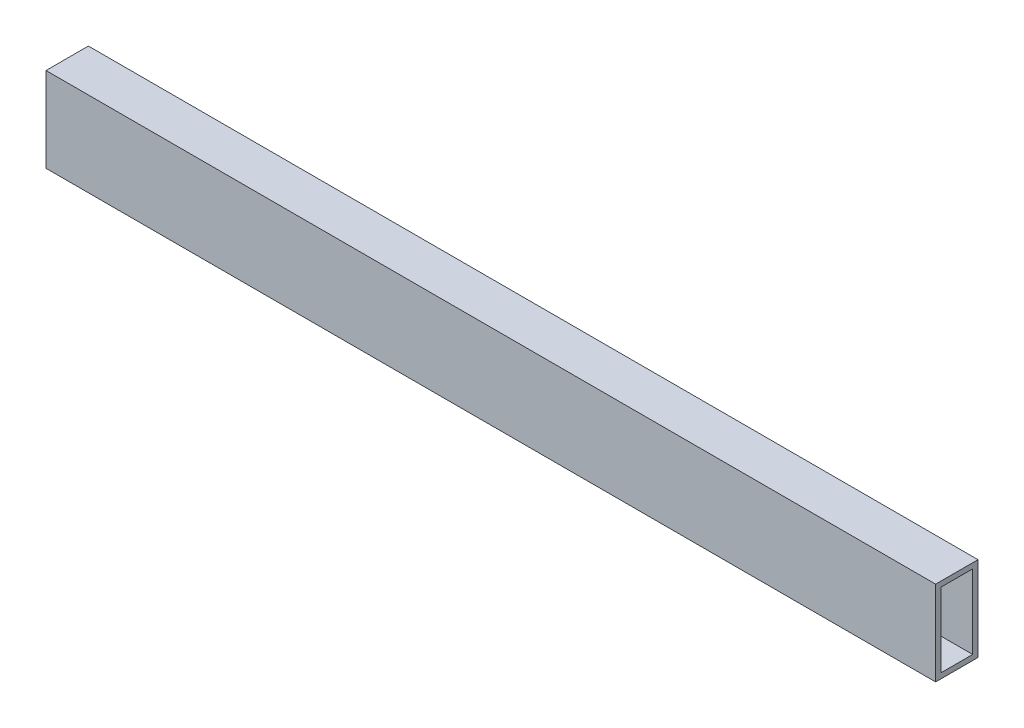
ISO-10303-21;
HEADER;
FILE_DESCRIPTION(('STEP AP214'),'2;1');
FILE_NAME('part.step','',(''),(''),'','','');
FILE_SCHEMA(('AUTOMOTIVE_DESIGN { 1 0 10303 214 1 1 1 1 }'));
ENDSEC;
DATA;
#1=APPLICATION_CONTEXT('core data for automotive mechanical design processes');
#2=APPLICATION_PROTOCOL_DEFINITION('international standard','automotive_design',2000,#1);
#3=PRODUCT_CONTEXT('',#1,'mechanical');
#4=PRODUCT('Part','Part','',(#3));
#5=PRODUCT_RELATED_PRODUCT_CATEGORY('part','',(#4));
#6=PRODUCT_DEFINITION_FORMATION('','',#4);
#7=PRODUCT_DEFINITION_CONTEXT('part definition',#1,'design');
#8=PRODUCT_DEFINITION('design','',#6,#7);
#9=PRODUCT_DEFINITION_SHAPE('','',#8);
#10=(LENGTH_UNIT() NAMED_UNIT(*) SI_UNIT(.MILLI.,.METRE.));
#11=(NAMED_UNIT(*) PLANE_ANGLE_UNIT() SI_UNIT($,.RADIAN.));
#12=(NAMED_UNIT(*) SI_UNIT($,.STERADIAN.) SOLID_ANGLE_UNIT());
#13=UNCERTAINTY_MEASURE_WITH_UNIT(LENGTH_MEASURE(1.E-05),#10,'distance_accuracy_value','');
#14=(GEOMETRIC_REPRESENTATION_CONTEXT(3) GLOBAL_UNCERTAINTY_ASSIGNED_CONTEXT((#13)) GLOBAL_UNIT_ASSIGNED_CONTEXT((#10,
#11,#12)) REPRESENTATION_CONTEXT('',''));
#15=CARTESIAN_POINT('',(0.,0.,0.));
#16=DIRECTION('',(0.,0.,1.));
#17=DIRECTION('',(1.,0.,0.));
#18=AXIS2_PLACEMENT_3D('',#15,#16,#17);
#19=CARTESIAN_POINT('',(533.4,0.,0.));
#20=DIRECTION('',(-1.,0.,0.));
#21=DIRECTION('',(0.,0.,1.));
#22=AXIS2_PLACEMENT_3D('',#19,#20,#21);
#23=PLANE('',#22);
#24=DIRECTION('',(0.,-1.,0.));
#25=VECTOR('',#24,1.);
#26=CARTESIAN_POINT('',(533.4,0.,0.));
#27=LINE('',#26,#25);
#28=CARTESIAN_POINT('',(533.4,50.8,0.));
#29=VERTEX_POINT('',#28);
#30=CARTESIAN_POINT('',(533.4,0.,0.));
#31=VERTEX_POINT('',#30);
#32=EDGE_CURVE('E134',#29,#31,#27,.T.);
#33=ORIENTED_EDGE('',*,*,#32,.T.);
#34=DIRECTION('',(0.,0.,-1.));
#35=VECTOR('',#34,1.);
#36=CARTESIAN_POINT('',(533.4,0.,0.));
#37=LINE('',#36,#35);
#38=CARTESIAN_POINT('',(533.4,0.,-25.4));
#39=VERTEX_POINT('',#38);
#40=EDGE_CURVE('E137',#31,#39,#37,.T.);
#41=ORIENTED_EDGE('',*,*,#40,.T.);
#42=DIRECTION('',(0.,1.,0.));
#43=VECTOR('',#42,1.);
#44=CARTESIAN_POINT('',(533.4,0.,-25.4));
#45=LINE('',#44,#43);
#46=CARTESIAN_POINT('',(533.4,50.8,-25.4));
#47=VERTEX_POINT('',#46);
#48=EDGE_CURVE('E140',#39,#47,#45,.T.);
#49=ORIENTED_EDGE('',*,*,#48,.T.);
#50=DIRECTION('',(0.,0.,1.));
#51=VECTOR('',#50,1.);
#52=CARTESIAN_POINT('',(533.4,50.8,0.));
#53=LINE('',#52,#51);
#54=EDGE_CURVE('E142',#47,#29,#53,.T.);
#55=ORIENTED_EDGE('',*,*,#54,.T.);
#56=EDGE_LOOP('',(#33,#41,#49,#55));
#57=FACE_BOUND('',#56,.T.);
#58=DIRECTION('',(0.,-1.,0.));
#59=VECTOR('',#58,1.);
#60=CARTESIAN_POINT('',(533.4,47.625,-3.175));
#61=LINE('',#60,#59);
#62=CARTESIAN_POINT('',(533.4,47.625,-3.175));
#63=VERTEX_POINT('',#62);
#64=CARTESIAN_POINT('',(533.4,3.175,-3.175));
#65=VERTEX_POINT('',#64);
#66=EDGE_CURVE('E98',#63,#65,#61,.T.);
#67=ORIENTED_EDGE('',*,*,#66,.F.);
#68=DIRECTION('',(0.,0.,1.));
#69=VECTOR('',#68,1.);
#70=CARTESIAN_POINT('',(533.4,47.625,-3.175));
#71=LINE('',#70,#69);
#72=CARTESIAN_POINT('',(533.4,47.625,-22.225));
#73=VERTEX_POINT('',#72);
#74=EDGE_CURVE('E120',#73,#63,#71,.T.);
#75=ORIENTED_EDGE('',*,*,#74,.F.);
#76=DIRECTION('',(0.,1.,0.));
#77=VECTOR('',#76,1.);
#78=CARTESIAN_POINT('',(533.4,47.625,-22.225));
#79=LINE('',#78,#77);
#80=CARTESIAN_POINT('',(533.4,3.175,-22.225));
#81=VERTEX_POINT('',#80);
#82=EDGE_CURVE('E118',#81,#73,#79,.T.);
#83=ORIENTED_EDGE('',*,*,#82,.F.);
#84=DIRECTION('',(0.,0.,-1.));
#85=VECTOR('',#84,1.);
#86=CARTESIAN_POINT('',(533.4,3.175,-3.175));
#87=LINE('',#86,#85);
#88=EDGE_CURVE('E106',#65,#81,#87,.T.);
#89=ORIENTED_EDGE('',*,*,#88,.F.);
#90=EDGE_LOOP('',(#67,#75,#83,#89));
#91=FACE_BOUND('',#90,.T.);
#92=ADVANCED_FACE('F33',(#57,#91),#23,.F.);
#93=CARTESIAN_POINT('',(0.,0.,0.));
#94=DIRECTION('',(-1.,0.,0.));
#95=DIRECTION('',(0.,0.,1.));
#96=AXIS2_PLACEMENT_3D('',#93,#94,#95);
#97=PLANE('',#96);
#98=DIRECTION('',(0.,-1.,0.));
#99=VECTOR('',#98,1.);
#100=CARTESIAN_POINT('',(0.,0.,0.));
#101=LINE('',#100,#99);
#102=CARTESIAN_POINT('',(0.,50.8,0.));
#103=VERTEX_POINT('',#102);
#104=CARTESIAN_POINT('',(0.,0.,0.));
#105=VERTEX_POINT('',#104);
#106=EDGE_CURVE('E114',#103,#105,#101,.T.);
#107=ORIENTED_EDGE('',*,*,#106,.F.);
#108=DIRECTION('',(0.,0.,1.));
#109=VECTOR('',#108,1.);
#110=CARTESIAN_POINT('',(0.,50.8,0.));
#111=LINE('',#110,#109);
#112=CARTESIAN_POINT('',(0.,50.8,-25.4));
#113=VERTEX_POINT('',#112);
#114=EDGE_CURVE('E138',#113,#103,#111,.T.);
#115=ORIENTED_EDGE('',*,*,#114,.F.);
#116=DIRECTION('',(0.,1.,0.));
#117=VECTOR('',#116,1.);
#118=CARTESIAN_POINT('',(0.,0.,-25.4));
#119=LINE('',#118,#117);
#120=CARTESIAN_POINT('',(0.,0.,-25.4));
#121=VERTEX_POINT('',#120);
#122=EDGE_CURVE('E149',#121,#113,#119,.T.);
#123=ORIENTED_EDGE('',*,*,#122,.F.);
#124=DIRECTION('',(0.,0.,-1.));
#125=VECTOR('',#124,1.);
#126=CARTESIAN_POINT('',(0.,0.,0.));
#127=LINE('',#126,#125);
#128=EDGE_CURVE('E147',#105,#121,#127,.T.);
#129=ORIENTED_EDGE('',*,*,#128,.F.);
#130=EDGE_LOOP('',(#107,#115,#123,#129));
#131=FACE_BOUND('',#130,.T.);
#132=DIRECTION('',(0.,0.,1.));
#133=VECTOR('',#132,1.);
#134=CARTESIAN_POINT('',(0.,47.625,-3.175));
#135=LINE('',#134,#133);
#136=CARTESIAN_POINT('',(0.,47.625,-22.225));
#137=VERTEX_POINT('',#136);
#138=CARTESIAN_POINT('',(0.,47.625,-3.175));
#139=VERTEX_POINT('',#138);
#140=EDGE_CURVE('E107',#137,#139,#135,.T.);
#141=ORIENTED_EDGE('',*,*,#140,.T.);
#142=DIRECTION('',(0.,-1.,0.));
#143=VECTOR('',#142,1.);
#144=CARTESIAN_POINT('',(0.,47.625,-3.175));
#145=LINE('',#144,#143);
#146=CARTESIAN_POINT('',(0.,3.175,-3.175));
#147=VERTEX_POINT('',#146);
#148=EDGE_CURVE('E56',#139,#147,#145,.T.);
#149=ORIENTED_EDGE('',*,*,#148,.T.);
#150=DIRECTION('',(0.,0.,-1.));
#151=VECTOR('',#150,1.);
#152=CARTESIAN_POINT('',(0.,3.175,-3.175));
#153=LINE('',#152,#151);
#154=CARTESIAN_POINT('',(0.,3.175,-22.225));
#155=VERTEX_POINT('',#154);
#156=EDGE_CURVE('E113',#147,#155,#153,.T.);
#157=ORIENTED_EDGE('',*,*,#156,.T.);
#158=DIRECTION('',(0.,1.,0.));
#159=VECTOR('',#158,1.);
#160=CARTESIAN_POINT('',(0.,47.625,-22.225));
#161=LINE('',#160,#159);
#162=EDGE_CURVE('E126',#155,#137,#161,.T.);
#163=ORIENTED_EDGE('',*,*,#162,.T.);
#164=EDGE_LOOP('',(#141,#149,#157,#163));
#165=FACE_BOUND('',#164,.T.);
#166=ADVANCED_FACE('F167',(#131,#165),#97,.T.);
#167=CARTESIAN_POINT('',(533.4,0.,0.));
#168=DIRECTION('',(0.,0.,-1.));
#169=DIRECTION('',(-1.,0.,0.));
#170=AXIS2_PLACEMENT_3D('',#167,#168,#169);
#171=PLANE('',#170);
#172=ORIENTED_EDGE('',*,*,#106,.T.);
#173=DIRECTION('',(-1.,0.,0.));
#174=VECTOR('',#173,1.);
#175=CARTESIAN_POINT('',(533.4,0.,0.));
#176=LINE('',#175,#174);
#177=EDGE_CURVE('E11',#31,#105,#176,.T.);
#178=ORIENTED_EDGE('',*,*,#177,.F.);
#179=ORIENTED_EDGE('',*,*,#32,.F.);
#180=DIRECTION('',(-1.,0.,0.));
#181=VECTOR('',#180,1.);
#182=CARTESIAN_POINT('',(533.4,50.8,0.));
#183=LINE('',#182,#181);
#184=EDGE_CURVE('E144',#29,#103,#183,.T.);
#185=ORIENTED_EDGE('',*,*,#184,.T.);
#186=EDGE_LOOP('',(#172,#178,#179,#185));
#187=FACE_BOUND('',#186,.T.);
#188=ADVANCED_FACE('F35',(#187),#171,.F.);
#189=CARTESIAN_POINT('',(533.4,0.,0.));
#190=DIRECTION('',(0.,1.,0.));
#191=DIRECTION('',(0.,0.,1.));
#192=AXIS2_PLACEMENT_3D('',#189,#190,#191);
#193=PLANE('',#192);
#194=ORIENTED_EDGE('',*,*,#128,.T.);
#195=DIRECTION('',(-1.,0.,0.));
#196=VECTOR('',#195,1.);
#197=CARTESIAN_POINT('',(533.4,0.,-25.4));
#198=LINE('',#197,#196);
#199=EDGE_CURVE('E41',#39,#121,#198,.T.);
#200=ORIENTED_EDGE('',*,*,#199,.F.);
#201=ORIENTED_EDGE('',*,*,#40,.F.);
#202=ORIENTED_EDGE('',*,*,#177,.T.);
#203=EDGE_LOOP('',(#194,#200,#201,#202));
#204=FACE_BOUND('',#203,.T.);
#205=ADVANCED_FACE('F177',(#204),#193,.F.);
#206=CARTESIAN_POINT('',(533.4,0.,-25.4));
#207=DIRECTION('',(0.,0.,1.));
#208=DIRECTION('',(1.,0.,0.));
#209=AXIS2_PLACEMENT_3D('',#206,#207,#208);
#210=PLANE('',#209);
#211=ORIENTED_EDGE('',*,*,#122,.T.);
#212=DIRECTION('',(-1.,0.,0.));
#213=VECTOR('',#212,1.);
#214=CARTESIAN_POINT('',(533.4,50.8,-25.4));
#215=LINE('',#214,#213);
#216=EDGE_CURVE('E154',#47,#113,#215,.T.);
#217=ORIENTED_EDGE('',*,*,#216,.F.);
#218=ORIENTED_EDGE('',*,*,#48,.F.);
#219=ORIENTED_EDGE('',*,*,#199,.T.);
#220=EDGE_LOOP('',(#211,#217,#218,#219));
#221=FACE_BOUND('',#220,.T.);
#222=ADVANCED_FACE('F161',(#221),#210,.F.);
#223=CARTESIAN_POINT('',(533.4,50.8,0.));
#224=DIRECTION('',(0.,-1.,0.));
#225=DIRECTION('',(0.,0.,-1.));
#226=AXIS2_PLACEMENT_3D('',#223,#224,#225);
#227=PLANE('',#226);
#228=ORIENTED_EDGE('',*,*,#114,.T.);
#229=ORIENTED_EDGE('',*,*,#184,.F.);
#230=ORIENTED_EDGE('',*,*,#54,.F.);
#231=ORIENTED_EDGE('',*,*,#216,.T.);
#232=EDGE_LOOP('',(#228,#229,#230,#231));
#233=FACE_BOUND('',#232,.T.);
#234=ADVANCED_FACE('F171',(#233),#227,.F.);
#235=CARTESIAN_POINT('',(533.4,47.625,-3.175));
#236=DIRECTION('',(0.,0.,-1.));
#237=DIRECTION('',(0.,1.,0.));
#238=AXIS2_PLACEMENT_3D('',#235,#236,#237);
#239=PLANE('',#238);
#240=ORIENTED_EDGE('',*,*,#148,.F.);
#241=DIRECTION('',(-1.,0.,0.));
#242=VECTOR('',#241,1.);
#243=CARTESIAN_POINT('',(533.4,47.625,-3.175));
#244=LINE('',#243,#242);
#245=EDGE_CURVE('E102',#63,#139,#244,.T.);
#246=ORIENTED_EDGE('',*,*,#245,.F.);
#247=ORIENTED_EDGE('',*,*,#66,.T.);
#248=DIRECTION('',(-1.,0.,0.));
#249=VECTOR('',#248,1.);
#250=CARTESIAN_POINT('',(533.4,3.175,-3.175));
#251=LINE('',#250,#249);
#252=EDGE_CURVE('E101',#65,#147,#251,.T.);
#253=ORIENTED_EDGE('',*,*,#252,.T.);
#254=EDGE_LOOP('',(#240,#246,#247,#253));
#255=FACE_BOUND('',#254,.T.);
#256=ADVANCED_FACE('F100',(#255),#239,.T.);
#257=CARTESIAN_POINT('',(533.4,3.175,-3.175));
#258=DIRECTION('',(0.,1.,0.));
#259=DIRECTION('',(0.,0.,1.));
#260=AXIS2_PLACEMENT_3D('',#257,#258,#259);
#261=PLANE('',#260);
#262=ORIENTED_EDGE('',*,*,#156,.F.);
#263=ORIENTED_EDGE('',*,*,#252,.F.);
#264=ORIENTED_EDGE('',*,*,#88,.T.);
#265=DIRECTION('',(-1.,0.,0.));
#266=VECTOR('',#265,1.);
#267=CARTESIAN_POINT('',(533.4,3.175,-22.225));
#268=LINE('',#267,#266);
#269=EDGE_CURVE('E115',#81,#155,#268,.T.);
#270=ORIENTED_EDGE('',*,*,#269,.T.);
#271=EDGE_LOOP('',(#262,#263,#264,#270));
#272=FACE_BOUND('',#271,.T.);
#273=ADVANCED_FACE('F110',(#272),#261,.T.);
#274=CARTESIAN_POINT('',(533.4,47.625,-22.225));
#275=DIRECTION('',(0.,0.,1.));
#276=DIRECTION('',(1.,0.,0.));
#277=AXIS2_PLACEMENT_3D('',#274,#275,#276);
#278=PLANE('',#277);
#279=ORIENTED_EDGE('',*,*,#162,.F.);
#280=ORIENTED_EDGE('',*,*,#269,.F.);
#281=ORIENTED_EDGE('',*,*,#82,.T.);
#282=DIRECTION('',(-1.,0.,0.));
#283=VECTOR('',#282,1.);
#284=CARTESIAN_POINT('',(533.4,47.625,-22.225));
#285=LINE('',#284,#283);
#286=EDGE_CURVE('E48',#73,#137,#285,.T.);
#287=ORIENTED_EDGE('',*,*,#286,.T.);
#288=EDGE_LOOP('',(#279,#280,#281,#287));
#289=FACE_BOUND('',#288,.T.);
#290=ADVANCED_FACE('F200',(#289),#278,.T.);
#291=CARTESIAN_POINT('',(533.4,47.625,-3.175));
#292=DIRECTION('',(0.,-1.,0.));
#293=DIRECTION('',(0.,0.,-1.));
#294=AXIS2_PLACEMENT_3D('',#291,#292,#293);
#295=PLANE('',#294);
#296=ORIENTED_EDGE('',*,*,#140,.F.);
#297=ORIENTED_EDGE('',*,*,#286,.F.);
#298=ORIENTED_EDGE('',*,*,#74,.T.);
#299=ORIENTED_EDGE('',*,*,#245,.T.);
#300=EDGE_LOOP('',(#296,#297,#298,#299));
#301=FACE_BOUND('',#300,.T.);
#302=ADVANCED_FACE('F204',(#301),#295,.T.);
#303=CLOSED_SHELL('',(#92,#166,#188,#205,#222,#234,#256,#273,#290,#302));
#304=MANIFOLD_SOLID_BREP('B2',#303);
#305=ADVANCED_BREP_SHAPE_REPRESENTATION('',(#18,#304),#14);
#306=SHAPE_DEFINITION_REPRESENTATION(#9,#305);
ENDSEC;
END-ISO-10303-21;
